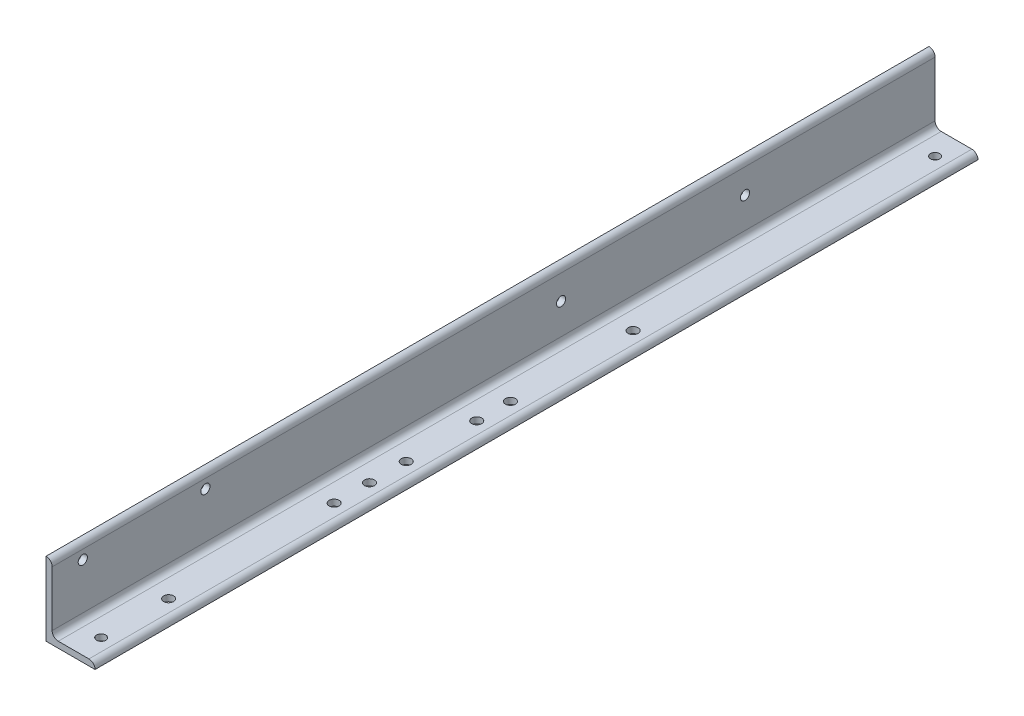
ISO-10303-21;
HEADER;
FILE_DESCRIPTION(('STEP AP214'),'2;1');
FILE_NAME('part.step','',(''),(''),'','','');
FILE_SCHEMA(('AUTOMOTIVE_DESIGN { 1 0 10303 214 1 1 1 1 }'));
ENDSEC;
DATA;
#1=APPLICATION_CONTEXT('core data for automotive mechanical design processes');
#2=APPLICATION_PROTOCOL_DEFINITION('international standard','automotive_design',2000,#1);
#3=PRODUCT_CONTEXT('',#1,'mechanical');
#4=PRODUCT('Part','Part','',(#3));
#5=PRODUCT_RELATED_PRODUCT_CATEGORY('part','',(#4));
#6=PRODUCT_DEFINITION_FORMATION('','',#4);
#7=PRODUCT_DEFINITION_CONTEXT('part definition',#1,'design');
#8=PRODUCT_DEFINITION('design','',#6,#7);
#9=PRODUCT_DEFINITION_SHAPE('','',#8);
#10=(LENGTH_UNIT() NAMED_UNIT(*) SI_UNIT(.MILLI.,.METRE.));
#11=(NAMED_UNIT(*) PLANE_ANGLE_UNIT() SI_UNIT($,.RADIAN.));
#12=(NAMED_UNIT(*) SI_UNIT($,.STERADIAN.) SOLID_ANGLE_UNIT());
#13=UNCERTAINTY_MEASURE_WITH_UNIT(LENGTH_MEASURE(1.E-05),#10,'distance_accuracy_value','');
#14=(GEOMETRIC_REPRESENTATION_CONTEXT(3) GLOBAL_UNCERTAINTY_ASSIGNED_CONTEXT((#13)) GLOBAL_UNIT_ASSIGNED_CONTEXT((#10,
#11,#12)) REPRESENTATION_CONTEXT('',''));
#15=CARTESIAN_POINT('',(0.,0.,0.));
#16=DIRECTION('',(0.,0.,1.));
#17=DIRECTION('',(1.,0.,0.));
#18=AXIS2_PLACEMENT_3D('',#15,#16,#17);
#19=CARTESIAN_POINT('',(101.6,0.,914.4));
#20=DIRECTION('',(0.,1.,0.));
#21=DIRECTION('',(-1.,0.,0.));
#22=AXIS2_PLACEMENT_3D('',#19,#20,#21);
#23=PLANE('',#22);
#24=CARTESIAN_POINT('',(63.5,0.,85.725));
#25=DIRECTION('',(0.,1.,0.));
#26=DIRECTION('',(-1.,0.,0.));
#27=AXIS2_PLACEMENT_3D('',#24,#25,#26);
#28=CIRCLE('',#27,10.31875);
#29=CARTESIAN_POINT('',(53.18125,0.,85.725));
#30=VERTEX_POINT('',#29);
#31=EDGE_CURVE('E224',#30,#30,#28,.F.);
#32=ORIENTED_EDGE('',*,*,#31,.F.);
#33=EDGE_LOOP('',(#32));
#34=FACE_BOUND('',#33,.T.);
#35=CARTESIAN_POINT('',(63.5,0.,307.975));
#36=DIRECTION('',(0.,1.,0.));
#37=DIRECTION('',(-1.,0.,0.));
#38=AXIS2_PLACEMENT_3D('',#35,#36,#37);
#39=CIRCLE('',#38,10.31875);
#40=CARTESIAN_POINT('',(53.18125,0.,307.975));
#41=VERTEX_POINT('',#40);
#42=EDGE_CURVE('E218',#41,#41,#39,.F.);
#43=ORIENTED_EDGE('',*,*,#42,.F.);
#44=EDGE_LOOP('',(#43));
#45=FACE_BOUND('',#44,.T.);
#46=CARTESIAN_POINT('',(63.5,0.,-238.125));
#47=DIRECTION('',(0.,1.,0.));
#48=DIRECTION('',(-1.,0.,0.));
#49=AXIS2_PLACEMENT_3D('',#46,#47,#48);
#50=CIRCLE('',#49,10.31875);
#51=CARTESIAN_POINT('',(53.18125,0.,-238.125));
#52=VERTEX_POINT('',#51);
#53=EDGE_CURVE('E212',#52,#52,#50,.F.);
#54=ORIENTED_EDGE('',*,*,#53,.F.);
#55=EDGE_LOOP('',(#54));
#56=FACE_BOUND('',#55,.T.);
#57=CARTESIAN_POINT('',(63.5,0.,231.775));
#58=DIRECTION('',(0.,1.,0.));
#59=DIRECTION('',(-1.,0.,0.));
#60=AXIS2_PLACEMENT_3D('',#57,#58,#59);
#61=CIRCLE('',#60,10.31875);
#62=CARTESIAN_POINT('',(53.18125,0.,231.775));
#63=VERTEX_POINT('',#62);
#64=EDGE_CURVE('E206',#63,#63,#61,.F.);
#65=ORIENTED_EDGE('',*,*,#64,.F.);
#66=EDGE_LOOP('',(#65));
#67=FACE_BOUND('',#66,.T.);
#68=CARTESIAN_POINT('',(63.5,0.,15.875));
#69=DIRECTION('',(0.,1.,0.));
#70=DIRECTION('',(-1.,0.,0.));
#71=AXIS2_PLACEMENT_3D('',#68,#69,#70);
#72=CIRCLE('',#71,10.31875);
#73=CARTESIAN_POINT('',(53.18125,0.,15.875));
#74=VERTEX_POINT('',#73);
#75=EDGE_CURVE('E200',#74,#74,#72,.F.);
#76=ORIENTED_EDGE('',*,*,#75,.F.);
#77=EDGE_LOOP('',(#76));
#78=FACE_BOUND('',#77,.T.);
#79=CARTESIAN_POINT('',(63.5,0.,381.));
#80=DIRECTION('',(0.,1.,0.));
#81=DIRECTION('',(-1.,0.,0.));
#82=AXIS2_PLACEMENT_3D('',#79,#80,#81);
#83=CIRCLE('',#82,10.31875);
#84=CARTESIAN_POINT('',(53.18125,0.,381.));
#85=VERTEX_POINT('',#84);
#86=EDGE_CURVE('E194',#85,#85,#83,.F.);
#87=ORIENTED_EDGE('',*,*,#86,.F.);
#88=EDGE_LOOP('',(#87));
#89=FACE_BOUND('',#88,.T.);
#90=CARTESIAN_POINT('',(63.5,0.,723.9));
#91=DIRECTION('',(0.,1.,0.));
#92=DIRECTION('',(-1.,0.,0.));
#93=AXIS2_PLACEMENT_3D('',#90,#91,#92);
#94=CIRCLE('',#93,10.31875);
#95=CARTESIAN_POINT('',(53.18125,0.,723.9));
#96=VERTEX_POINT('',#95);
#97=EDGE_CURVE('E188',#96,#96,#94,.F.);
#98=ORIENTED_EDGE('',*,*,#97,.F.);
#99=EDGE_LOOP('',(#98));
#100=FACE_BOUND('',#99,.T.);
#101=CARTESIAN_POINT('',(63.5,0.,-863.6));
#102=DIRECTION('',(0.,1.,0.));
#103=DIRECTION('',(-1.,0.,0.));
#104=AXIS2_PLACEMENT_3D('',#101,#102,#103);
#105=CIRCLE('',#104,9.525);
#106=CARTESIAN_POINT('',(53.975,0.,-863.6));
#107=VERTEX_POINT('',#106);
#108=EDGE_CURVE('E182',#107,#107,#105,.F.);
#109=ORIENTED_EDGE('',*,*,#108,.F.);
#110=EDGE_LOOP('',(#109));
#111=FACE_BOUND('',#110,.T.);
#112=CARTESIAN_POINT('',(63.5,0.,863.6));
#113=DIRECTION('',(0.,1.,0.));
#114=DIRECTION('',(-1.,0.,0.));
#115=AXIS2_PLACEMENT_3D('',#112,#113,#114);
#116=CIRCLE('',#115,9.525);
#117=CARTESIAN_POINT('',(53.975,0.,863.6));
#118=VERTEX_POINT('',#117);
#119=EDGE_CURVE('E123',#118,#118,#116,.F.);
#120=ORIENTED_EDGE('',*,*,#119,.F.);
#121=EDGE_LOOP('',(#120));
#122=FACE_BOUND('',#121,.T.);
#123=DIRECTION('',(1.,0.,0.));
#124=VECTOR('',#123,1.);
#125=CARTESIAN_POINT('',(101.6,0.,-914.4));
#126=LINE('',#125,#124);
#127=CARTESIAN_POINT('',(0.,0.,-914.4));
#128=VERTEX_POINT('',#127);
#129=CARTESIAN_POINT('',(101.6,0.,-914.4));
#130=VERTEX_POINT('',#129);
#131=EDGE_CURVE('E119',#128,#130,#126,.T.);
#132=ORIENTED_EDGE('',*,*,#131,.T.);
#133=DIRECTION('',(0.,0.,-1.));
#134=VECTOR('',#133,1.);
#135=CARTESIAN_POINT('',(101.6,0.,914.4));
#136=LINE('',#135,#134);
#137=CARTESIAN_POINT('',(101.6,0.,914.4));
#138=VERTEX_POINT('',#137);
#139=EDGE_CURVE('E11',#138,#130,#136,.T.);
#140=ORIENTED_EDGE('',*,*,#139,.F.);
#141=DIRECTION('',(1.,0.,0.));
#142=VECTOR('',#141,1.);
#143=CARTESIAN_POINT('',(101.6,0.,914.4));
#144=LINE('',#143,#142);
#145=CARTESIAN_POINT('',(0.,0.,914.4));
#146=VERTEX_POINT('',#145);
#147=EDGE_CURVE('E136',#146,#138,#144,.T.);
#148=ORIENTED_EDGE('',*,*,#147,.F.);
#149=DIRECTION('',(0.,0.,-1.));
#150=VECTOR('',#149,1.);
#151=CARTESIAN_POINT('',(0.,0.,914.4));
#152=LINE('',#151,#150);
#153=EDGE_CURVE('E115',#146,#128,#152,.T.);
#154=ORIENTED_EDGE('',*,*,#153,.T.);
#155=EDGE_LOOP('',(#132,#140,#148,#154));
#156=FACE_BOUND('',#155,.T.);
#157=ADVANCED_FACE('F17',(#34,#45,#56,#67,#78,#89,#100,#111,#122,#156),#23,.F.);
#158=CARTESIAN_POINT('',(101.6,0.00508000000000622,914.4));
#159=DIRECTION('',(-1.,0.,0.));
#160=DIRECTION('',(0.,0.,1.));
#161=AXIS2_PLACEMENT_3D('',#158,#159,#160);
#162=PLANE('',#161);
#163=DIRECTION('',(0.,1.,0.));
#164=VECTOR('',#163,1.);
#165=CARTESIAN_POINT('',(101.6,0.00508000000000622,-914.4));
#166=LINE('',#165,#164);
#167=CARTESIAN_POINT('',(101.6,0.00508000000000622,-914.4));
#168=VERTEX_POINT('',#167);
#169=EDGE_CURVE('E122',#130,#168,#166,.T.);
#170=ORIENTED_EDGE('',*,*,#169,.T.);
#171=DIRECTION('',(0.,0.,-1.));
#172=VECTOR('',#171,1.);
#173=CARTESIAN_POINT('',(101.6,0.00508000000000622,914.4));
#174=LINE('',#173,#172);
#175=CARTESIAN_POINT('',(101.6,0.00508000000000622,914.4));
#176=VERTEX_POINT('',#175);
#177=EDGE_CURVE('E25',#176,#168,#174,.T.);
#178=ORIENTED_EDGE('',*,*,#177,.F.);
#179=DIRECTION('',(0.,1.,0.));
#180=VECTOR('',#179,1.);
#181=CARTESIAN_POINT('',(101.6,0.00508000000000622,914.4));
#182=LINE('',#181,#180);
#183=EDGE_CURVE('E79',#138,#176,#182,.T.);
#184=ORIENTED_EDGE('',*,*,#183,.F.);
#185=ORIENTED_EDGE('',*,*,#139,.T.);
#186=EDGE_LOOP('',(#170,#178,#184,#185));
#187=FACE_BOUND('',#186,.T.);
#188=ADVANCED_FACE('F287',(#187),#162,.F.);
#189=CARTESIAN_POINT('',(88.90508,0.00508000000000467,914.4));
#190=DIRECTION('',(0.,0.,-1.));
#191=DIRECTION('',(-1.,0.,0.));
#192=AXIS2_PLACEMENT_3D('',#189,#190,#191);
#193=CYLINDRICAL_SURFACE('',#192,12.69492);
#194=CARTESIAN_POINT('',(88.90508,0.00508000000000467,-914.4));
#195=DIRECTION('',(0.,0.,1.));
#196=DIRECTION('',(1.,0.,0.));
#197=AXIS2_PLACEMENT_3D('',#194,#195,#196);
#198=CIRCLE('',#197,12.69492);
#199=CARTESIAN_POINT('',(88.90508,12.7,-914.4));
#200=VERTEX_POINT('',#199);
#201=EDGE_CURVE('E125',#168,#200,#198,.T.);
#202=ORIENTED_EDGE('',*,*,#201,.T.);
#203=DIRECTION('',(0.,0.,-1.));
#204=VECTOR('',#203,1.);
#205=CARTESIAN_POINT('',(88.90508,12.7,914.4));
#206=LINE('',#205,#204);
#207=CARTESIAN_POINT('',(88.90508,12.7,914.4));
#208=VERTEX_POINT('',#207);
#209=EDGE_CURVE('E146',#208,#200,#206,.T.);
#210=ORIENTED_EDGE('',*,*,#209,.F.);
#211=CARTESIAN_POINT('',(88.90508,0.00508000000000467,914.4));
#212=DIRECTION('',(0.,0.,1.));
#213=DIRECTION('',(1.,0.,0.));
#214=AXIS2_PLACEMENT_3D('',#211,#212,#213);
#215=CIRCLE('',#214,12.69492);
#216=EDGE_CURVE('E154',#176,#208,#215,.T.);
#217=ORIENTED_EDGE('',*,*,#216,.F.);
#218=ORIENTED_EDGE('',*,*,#177,.T.);
#219=EDGE_LOOP('',(#202,#210,#217,#218));
#220=FACE_BOUND('',#219,.T.);
#221=ADVANCED_FACE('F152',(#220),#193,.T.);
#222=CARTESIAN_POINT('',(25.4,12.7,914.4));
#223=DIRECTION('',(0.,-1.,0.));
#224=DIRECTION('',(0.,0.,-1.));
#225=AXIS2_PLACEMENT_3D('',#222,#223,#224);
#226=PLANE('',#225);
#227=CARTESIAN_POINT('',(63.5,12.7,85.725));
#228=DIRECTION('',(0.,1.,0.));
#229=DIRECTION('',(-1.,0.,0.));
#230=AXIS2_PLACEMENT_3D('',#227,#228,#229);
#231=CIRCLE('',#230,10.31875);
#232=CARTESIAN_POINT('',(53.18125,12.7,85.725));
#233=VERTEX_POINT('',#232);
#234=EDGE_CURVE('E227',#233,#233,#231,.T.);
#235=ORIENTED_EDGE('',*,*,#234,.F.);
#236=EDGE_LOOP('',(#235));
#237=FACE_BOUND('',#236,.T.);
#238=CARTESIAN_POINT('',(63.5,12.7,307.975));
#239=DIRECTION('',(0.,1.,0.));
#240=DIRECTION('',(-1.,0.,0.));
#241=AXIS2_PLACEMENT_3D('',#238,#239,#240);
#242=CIRCLE('',#241,10.31875);
#243=CARTESIAN_POINT('',(53.18125,12.7,307.975));
#244=VERTEX_POINT('',#243);
#245=EDGE_CURVE('E221',#244,#244,#242,.T.);
#246=ORIENTED_EDGE('',*,*,#245,.F.);
#247=EDGE_LOOP('',(#246));
#248=FACE_BOUND('',#247,.T.);
#249=CARTESIAN_POINT('',(63.5,12.7,-238.125));
#250=DIRECTION('',(0.,1.,0.));
#251=DIRECTION('',(-1.,0.,0.));
#252=AXIS2_PLACEMENT_3D('',#249,#250,#251);
#253=CIRCLE('',#252,10.31875);
#254=CARTESIAN_POINT('',(53.18125,12.7,-238.125));
#255=VERTEX_POINT('',#254);
#256=EDGE_CURVE('E215',#255,#255,#253,.T.);
#257=ORIENTED_EDGE('',*,*,#256,.F.);
#258=EDGE_LOOP('',(#257));
#259=FACE_BOUND('',#258,.T.);
#260=CARTESIAN_POINT('',(63.5,12.7,231.775));
#261=DIRECTION('',(0.,1.,0.));
#262=DIRECTION('',(-1.,0.,0.));
#263=AXIS2_PLACEMENT_3D('',#260,#261,#262);
#264=CIRCLE('',#263,10.31875);
#265=CARTESIAN_POINT('',(53.18125,12.7,231.775));
#266=VERTEX_POINT('',#265);
#267=EDGE_CURVE('E209',#266,#266,#264,.T.);
#268=ORIENTED_EDGE('',*,*,#267,.F.);
#269=EDGE_LOOP('',(#268));
#270=FACE_BOUND('',#269,.T.);
#271=CARTESIAN_POINT('',(63.5,12.7,15.875));
#272=DIRECTION('',(0.,1.,0.));
#273=DIRECTION('',(-1.,0.,0.));
#274=AXIS2_PLACEMENT_3D('',#271,#272,#273);
#275=CIRCLE('',#274,10.31875);
#276=CARTESIAN_POINT('',(53.18125,12.7,15.875));
#277=VERTEX_POINT('',#276);
#278=EDGE_CURVE('E203',#277,#277,#275,.T.);
#279=ORIENTED_EDGE('',*,*,#278,.F.);
#280=EDGE_LOOP('',(#279));
#281=FACE_BOUND('',#280,.T.);
#282=CARTESIAN_POINT('',(63.5,12.7,381.));
#283=DIRECTION('',(0.,1.,0.));
#284=DIRECTION('',(-1.,0.,0.));
#285=AXIS2_PLACEMENT_3D('',#282,#283,#284);
#286=CIRCLE('',#285,10.31875);
#287=CARTESIAN_POINT('',(53.18125,12.7,381.));
#288=VERTEX_POINT('',#287);
#289=EDGE_CURVE('E197',#288,#288,#286,.T.);
#290=ORIENTED_EDGE('',*,*,#289,.F.);
#291=EDGE_LOOP('',(#290));
#292=FACE_BOUND('',#291,.T.);
#293=CARTESIAN_POINT('',(63.5,12.7,723.9));
#294=DIRECTION('',(0.,1.,0.));
#295=DIRECTION('',(-1.,0.,0.));
#296=AXIS2_PLACEMENT_3D('',#293,#294,#295);
#297=CIRCLE('',#296,10.31875);
#298=CARTESIAN_POINT('',(53.18125,12.7,723.9));
#299=VERTEX_POINT('',#298);
#300=EDGE_CURVE('E191',#299,#299,#297,.T.);
#301=ORIENTED_EDGE('',*,*,#300,.F.);
#302=EDGE_LOOP('',(#301));
#303=FACE_BOUND('',#302,.T.);
#304=CARTESIAN_POINT('',(63.5,12.7,-863.6));
#305=DIRECTION('',(0.,1.,0.));
#306=DIRECTION('',(-1.,0.,0.));
#307=AXIS2_PLACEMENT_3D('',#304,#305,#306);
#308=CIRCLE('',#307,9.525);
#309=CARTESIAN_POINT('',(53.975,12.7,-863.6));
#310=VERTEX_POINT('',#309);
#311=EDGE_CURVE('E185',#310,#310,#308,.T.);
#312=ORIENTED_EDGE('',*,*,#311,.F.);
#313=EDGE_LOOP('',(#312));
#314=FACE_BOUND('',#313,.T.);
#315=CARTESIAN_POINT('',(63.5,12.7,863.6));
#316=DIRECTION('',(0.,1.,0.));
#317=DIRECTION('',(-1.,0.,0.));
#318=AXIS2_PLACEMENT_3D('',#315,#316,#317);
#319=CIRCLE('',#318,9.525);
#320=CARTESIAN_POINT('',(53.975,12.7,863.6));
#321=VERTEX_POINT('',#320);
#322=EDGE_CURVE('E179',#321,#321,#319,.T.);
#323=ORIENTED_EDGE('',*,*,#322,.F.);
#324=EDGE_LOOP('',(#323));
#325=FACE_BOUND('',#324,.T.);
#326=DIRECTION('',(-1.,0.,0.));
#327=VECTOR('',#326,1.);
#328=CARTESIAN_POINT('',(25.4,12.7,-914.4));
#329=LINE('',#328,#327);
#330=CARTESIAN_POINT('',(25.4,12.7,-914.4));
#331=VERTEX_POINT('',#330);
#332=EDGE_CURVE('E127',#200,#331,#329,.T.);
#333=ORIENTED_EDGE('',*,*,#332,.T.);
#334=DIRECTION('',(0.,0.,-1.));
#335=VECTOR('',#334,1.);
#336=CARTESIAN_POINT('',(25.4,12.7,914.4));
#337=LINE('',#336,#335);
#338=CARTESIAN_POINT('',(25.4,12.7,914.4));
#339=VERTEX_POINT('',#338);
#340=EDGE_CURVE('E143',#339,#331,#337,.T.);
#341=ORIENTED_EDGE('',*,*,#340,.F.);
#342=DIRECTION('',(-1.,0.,0.));
#343=VECTOR('',#342,1.);
#344=CARTESIAN_POINT('',(25.4,12.7,914.4));
#345=LINE('',#344,#343);
#346=EDGE_CURVE('E170',#208,#339,#345,.T.);
#347=ORIENTED_EDGE('',*,*,#346,.F.);
#348=ORIENTED_EDGE('',*,*,#209,.T.);
#349=EDGE_LOOP('',(#333,#341,#347,#348));
#350=FACE_BOUND('',#349,.T.);
#351=ADVANCED_FACE('F163',(#237,#248,#259,#270,#281,#292,#303,#314,#325,#350),#226,.F.);
#352=CARTESIAN_POINT('',(25.4,25.4,914.4));
#353=DIRECTION('',(0.,0.,-1.));
#354=DIRECTION('',(-1.,0.,0.));
#355=AXIS2_PLACEMENT_3D('',#352,#353,#354);
#356=CYLINDRICAL_SURFACE('',#355,12.7);
#357=CARTESIAN_POINT('',(25.4,25.4,-914.4));
#358=DIRECTION('',(0.,0.,-1.));
#359=DIRECTION('',(-1.,0.,0.));
#360=AXIS2_PLACEMENT_3D('',#357,#358,#359);
#361=CIRCLE('',#360,12.7);
#362=CARTESIAN_POINT('',(12.7,25.4,-914.4));
#363=VERTEX_POINT('',#362);
#364=EDGE_CURVE('E129',#331,#363,#361,.T.);
#365=ORIENTED_EDGE('',*,*,#364,.T.);
#366=DIRECTION('',(0.,0.,-1.));
#367=VECTOR('',#366,1.);
#368=CARTESIAN_POINT('',(12.7,25.4,914.4));
#369=LINE('',#368,#367);
#370=CARTESIAN_POINT('',(12.7,25.4,914.4));
#371=VERTEX_POINT('',#370);
#372=EDGE_CURVE('E140',#371,#363,#369,.T.);
#373=ORIENTED_EDGE('',*,*,#372,.F.);
#374=CARTESIAN_POINT('',(25.4,25.4,914.4));
#375=DIRECTION('',(0.,0.,-1.));
#376=DIRECTION('',(-1.,0.,0.));
#377=AXIS2_PLACEMENT_3D('',#374,#375,#376);
#378=CIRCLE('',#377,12.7);
#379=EDGE_CURVE('E169',#339,#371,#378,.T.);
#380=ORIENTED_EDGE('',*,*,#379,.F.);
#381=ORIENTED_EDGE('',*,*,#340,.T.);
#382=EDGE_LOOP('',(#365,#373,#380,#381));
#383=FACE_BOUND('',#382,.T.);
#384=ADVANCED_FACE('F167',(#383),#356,.F.);
#385=CARTESIAN_POINT('',(12.7,139.70508,914.4));
#386=DIRECTION('',(-1.,0.,0.));
#387=DIRECTION('',(0.,-1.,0.));
#388=AXIS2_PLACEMENT_3D('',#385,#386,#387);
#389=PLANE('',#388);
#390=CARTESIAN_POINT('',(12.7,88.9,-520.7));
#391=DIRECTION('',(1.,0.,0.));
#392=DIRECTION('',(0.,1.,0.));
#393=AXIS2_PLACEMENT_3D('',#390,#391,#392);
#394=CIRCLE('',#393,9.525);
#395=CARTESIAN_POINT('',(12.7,98.425,-520.7));
#396=VERTEX_POINT('',#395);
#397=EDGE_CURVE('E251',#396,#396,#394,.T.);
#398=ORIENTED_EDGE('',*,*,#397,.F.);
#399=EDGE_LOOP('',(#398));
#400=FACE_BOUND('',#399,.T.);
#401=CARTESIAN_POINT('',(12.7,88.9,-139.7));
#402=DIRECTION('',(1.,0.,0.));
#403=DIRECTION('',(0.,1.,0.));
#404=AXIS2_PLACEMENT_3D('',#401,#402,#403);
#405=CIRCLE('',#404,9.525);
#406=CARTESIAN_POINT('',(12.7,98.425,-139.7));
#407=VERTEX_POINT('',#406);
#408=EDGE_CURVE('E245',#407,#407,#405,.T.);
#409=ORIENTED_EDGE('',*,*,#408,.F.);
#410=EDGE_LOOP('',(#409));
#411=FACE_BOUND('',#410,.T.);
#412=CARTESIAN_POINT('',(12.7,120.65,596.9));
#413=DIRECTION('',(1.,0.,0.));
#414=DIRECTION('',(0.,1.,0.));
#415=AXIS2_PLACEMENT_3D('',#412,#413,#414);
#416=CIRCLE('',#415,9.525);
#417=CARTESIAN_POINT('',(12.7,130.175,596.9));
#418=VERTEX_POINT('',#417);
#419=EDGE_CURVE('E239',#418,#418,#416,.T.);
#420=ORIENTED_EDGE('',*,*,#419,.F.);
#421=EDGE_LOOP('',(#420));
#422=FACE_BOUND('',#421,.T.);
#423=CARTESIAN_POINT('',(12.7,120.65,850.9));
#424=DIRECTION('',(1.,0.,0.));
#425=DIRECTION('',(0.,1.,0.));
#426=AXIS2_PLACEMENT_3D('',#423,#424,#425);
#427=CIRCLE('',#426,9.525);
#428=CARTESIAN_POINT('',(12.7,130.175,850.9));
#429=VERTEX_POINT('',#428);
#430=EDGE_CURVE('E233',#429,#429,#427,.T.);
#431=ORIENTED_EDGE('',*,*,#430,.F.);
#432=EDGE_LOOP('',(#431));
#433=FACE_BOUND('',#432,.T.);
#434=DIRECTION('',(0.,1.,0.));
#435=VECTOR('',#434,1.);
#436=CARTESIAN_POINT('',(12.7,139.70508,-914.4));
#437=LINE('',#436,#435);
#438=CARTESIAN_POINT('',(12.7,139.70508,-914.4));
#439=VERTEX_POINT('',#438);
#440=EDGE_CURVE('E131',#363,#439,#437,.T.);
#441=ORIENTED_EDGE('',*,*,#440,.T.);
#442=DIRECTION('',(0.,0.,-1.));
#443=VECTOR('',#442,1.);
#444=CARTESIAN_POINT('',(12.7,139.70508,914.4));
#445=LINE('',#444,#443);
#446=CARTESIAN_POINT('',(12.7,139.70508,914.4));
#447=VERTEX_POINT('',#446);
#448=EDGE_CURVE('E110',#447,#439,#445,.T.);
#449=ORIENTED_EDGE('',*,*,#448,.F.);
#450=DIRECTION('',(0.,1.,0.));
#451=VECTOR('',#450,1.);
#452=CARTESIAN_POINT('',(12.7,139.70508,914.4));
#453=LINE('',#452,#451);
#454=EDGE_CURVE('E101',#371,#447,#453,.T.);
#455=ORIENTED_EDGE('',*,*,#454,.F.);
#456=ORIENTED_EDGE('',*,*,#372,.T.);
#457=EDGE_LOOP('',(#441,#449,#455,#456));
#458=FACE_BOUND('',#457,.T.);
#459=ADVANCED_FACE('F258',(#400,#411,#422,#433,#458),#389,.F.);
#460=CARTESIAN_POINT('',(0.00508000000000078,139.70508,914.4));
#461=DIRECTION('',(0.,0.,-1.));
#462=DIRECTION('',(-1.,0.,0.));
#463=AXIS2_PLACEMENT_3D('',#460,#461,#462);
#464=CYLINDRICAL_SURFACE('',#463,12.69492);
#465=CARTESIAN_POINT('',(0.00508000000000078,139.70508,-914.4));
#466=DIRECTION('',(0.,0.,1.));
#467=DIRECTION('',(-1.,0.,0.));
#468=AXIS2_PLACEMENT_3D('',#465,#466,#467);
#469=CIRCLE('',#468,12.69492);
#470=CARTESIAN_POINT('',(0.00508,152.4,-914.4));
#471=VERTEX_POINT('',#470);
#472=EDGE_CURVE('E109',#439,#471,#469,.T.);
#473=ORIENTED_EDGE('',*,*,#472,.T.);
#474=DIRECTION('',(0.,0.,-1.));
#475=VECTOR('',#474,1.);
#476=CARTESIAN_POINT('',(0.00508,152.4,914.4));
#477=LINE('',#476,#475);
#478=CARTESIAN_POINT('',(0.00508,152.4,914.4));
#479=VERTEX_POINT('',#478);
#480=EDGE_CURVE('E106',#479,#471,#477,.T.);
#481=ORIENTED_EDGE('',*,*,#480,.F.);
#482=CARTESIAN_POINT('',(0.00508000000000078,139.70508,914.4));
#483=DIRECTION('',(0.,0.,1.));
#484=DIRECTION('',(-1.,0.,0.));
#485=AXIS2_PLACEMENT_3D('',#482,#483,#484);
#486=CIRCLE('',#485,12.69492);
#487=EDGE_CURVE('E95',#447,#479,#486,.T.);
#488=ORIENTED_EDGE('',*,*,#487,.F.);
#489=ORIENTED_EDGE('',*,*,#448,.T.);
#490=EDGE_LOOP('',(#473,#481,#488,#489));
#491=FACE_BOUND('',#490,.T.);
#492=ADVANCED_FACE('F107',(#491),#464,.T.);
#493=CARTESIAN_POINT('',(0.,152.4,914.4));
#494=DIRECTION('',(0.,-1.,0.));
#495=DIRECTION('',(0.,0.,-1.));
#496=AXIS2_PLACEMENT_3D('',#493,#494,#495);
#497=PLANE('',#496);
#498=DIRECTION('',(-1.,0.,0.));
#499=VECTOR('',#498,1.);
#500=CARTESIAN_POINT('',(0.,152.4,-914.4));
#501=LINE('',#500,#499);
#502=CARTESIAN_POINT('',(0.,152.4,-914.4));
#503=VERTEX_POINT('',#502);
#504=EDGE_CURVE('E65',#471,#503,#501,.T.);
#505=ORIENTED_EDGE('',*,*,#504,.T.);
#506=DIRECTION('',(0.,0.,-1.));
#507=VECTOR('',#506,1.);
#508=CARTESIAN_POINT('',(0.,152.4,914.4));
#509=LINE('',#508,#507);
#510=CARTESIAN_POINT('',(0.,152.4,914.4));
#511=VERTEX_POINT('',#510);
#512=EDGE_CURVE('E111',#511,#503,#509,.T.);
#513=ORIENTED_EDGE('',*,*,#512,.F.);
#514=DIRECTION('',(-1.,0.,0.));
#515=VECTOR('',#514,1.);
#516=CARTESIAN_POINT('',(0.,152.4,914.4));
#517=LINE('',#516,#515);
#518=EDGE_CURVE('E99',#479,#511,#517,.T.);
#519=ORIENTED_EDGE('',*,*,#518,.F.);
#520=ORIENTED_EDGE('',*,*,#480,.T.);
#521=EDGE_LOOP('',(#505,#513,#519,#520));
#522=FACE_BOUND('',#521,.T.);
#523=ADVANCED_FACE('F113',(#522),#497,.F.);
#524=CARTESIAN_POINT('',(0.,0.,914.4));
#525=DIRECTION('',(1.,0.,0.));
#526=DIRECTION('',(0.,0.,-1.));
#527=AXIS2_PLACEMENT_3D('',#524,#525,#526);
#528=PLANE('',#527);
#529=CARTESIAN_POINT('',(0.,88.9,-520.7));
#530=DIRECTION('',(1.,0.,0.));
#531=DIRECTION('',(0.,0.,-1.));
#532=AXIS2_PLACEMENT_3D('',#529,#530,#531);
#533=CIRCLE('',#532,9.525);
#534=CARTESIAN_POINT('',(0.,88.9,-530.225));
#535=VERTEX_POINT('',#534);
#536=EDGE_CURVE('E248',#535,#535,#533,.F.);
#537=ORIENTED_EDGE('',*,*,#536,.F.);
#538=EDGE_LOOP('',(#537));
#539=FACE_BOUND('',#538,.T.);
#540=CARTESIAN_POINT('',(0.,88.9,-139.7));
#541=DIRECTION('',(1.,0.,0.));
#542=DIRECTION('',(0.,0.,-1.));
#543=AXIS2_PLACEMENT_3D('',#540,#541,#542);
#544=CIRCLE('',#543,9.525);
#545=CARTESIAN_POINT('',(0.,88.9,-149.225));
#546=VERTEX_POINT('',#545);
#547=EDGE_CURVE('E242',#546,#546,#544,.F.);
#548=ORIENTED_EDGE('',*,*,#547,.F.);
#549=EDGE_LOOP('',(#548));
#550=FACE_BOUND('',#549,.T.);
#551=CARTESIAN_POINT('',(0.,120.65,596.9));
#552=DIRECTION('',(1.,0.,0.));
#553=DIRECTION('',(0.,0.,-1.));
#554=AXIS2_PLACEMENT_3D('',#551,#552,#553);
#555=CIRCLE('',#554,9.525);
#556=CARTESIAN_POINT('',(0.,120.65,587.375));
#557=VERTEX_POINT('',#556);
#558=EDGE_CURVE('E236',#557,#557,#555,.F.);
#559=ORIENTED_EDGE('',*,*,#558,.F.);
#560=EDGE_LOOP('',(#559));
#561=FACE_BOUND('',#560,.T.);
#562=CARTESIAN_POINT('',(0.,120.65,850.9));
#563=DIRECTION('',(1.,0.,0.));
#564=DIRECTION('',(0.,0.,-1.));
#565=AXIS2_PLACEMENT_3D('',#562,#563,#564);
#566=CIRCLE('',#565,9.525);
#567=CARTESIAN_POINT('',(0.,120.65,841.375));
#568=VERTEX_POINT('',#567);
#569=EDGE_CURVE('E230',#568,#568,#566,.F.);
#570=ORIENTED_EDGE('',*,*,#569,.F.);
#571=EDGE_LOOP('',(#570));
#572=FACE_BOUND('',#571,.T.);
#573=DIRECTION('',(0.,-1.,0.));
#574=VECTOR('',#573,1.);
#575=CARTESIAN_POINT('',(0.,0.,-914.4));
#576=LINE('',#575,#574);
#577=EDGE_CURVE('E71',#503,#128,#576,.T.);
#578=ORIENTED_EDGE('',*,*,#577,.T.);
#579=ORIENTED_EDGE('',*,*,#153,.F.);
#580=DIRECTION('',(0.,-1.,0.));
#581=VECTOR('',#580,1.);
#582=CARTESIAN_POINT('',(0.,0.,914.4));
#583=LINE('',#582,#581);
#584=EDGE_CURVE('E33',#511,#146,#583,.T.);
#585=ORIENTED_EDGE('',*,*,#584,.F.);
#586=ORIENTED_EDGE('',*,*,#512,.T.);
#587=EDGE_LOOP('',(#578,#579,#585,#586));
#588=FACE_BOUND('',#587,.T.);
#589=ADVANCED_FACE('F271',(#539,#550,#561,#572,#588),#528,.F.);
#590=CARTESIAN_POINT('',(0.00508000000000078,139.70508,914.4));
#591=DIRECTION('',(0.,0.,-1.));
#592=DIRECTION('',(-1.,0.,0.));
#593=AXIS2_PLACEMENT_3D('',#590,#591,#592);
#594=PLANE('',#593);
#595=ORIENTED_EDGE('',*,*,#147,.T.);
#596=ORIENTED_EDGE('',*,*,#183,.T.);
#597=ORIENTED_EDGE('',*,*,#216,.T.);
#598=ORIENTED_EDGE('',*,*,#346,.T.);
#599=ORIENTED_EDGE('',*,*,#379,.T.);
#600=ORIENTED_EDGE('',*,*,#454,.T.);
#601=ORIENTED_EDGE('',*,*,#487,.T.);
#602=ORIENTED_EDGE('',*,*,#518,.T.);
#603=ORIENTED_EDGE('',*,*,#584,.T.);
#604=EDGE_LOOP('',(#595,#596,#597,#598,#599,#600,#601,#602,#603));
#605=FACE_BOUND('',#604,.T.);
#606=ADVANCED_FACE('F97',(#605),#594,.F.);
#607=CARTESIAN_POINT('',(0.00508000000000078,139.70508,-914.4));
#608=DIRECTION('',(0.,0.,-1.));
#609=DIRECTION('',(-1.,0.,0.));
#610=AXIS2_PLACEMENT_3D('',#607,#608,#609);
#611=PLANE('',#610);
#612=ORIENTED_EDGE('',*,*,#131,.F.);
#613=ORIENTED_EDGE('',*,*,#577,.F.);
#614=ORIENTED_EDGE('',*,*,#504,.F.);
#615=ORIENTED_EDGE('',*,*,#472,.F.);
#616=ORIENTED_EDGE('',*,*,#440,.F.);
#617=ORIENTED_EDGE('',*,*,#364,.F.);
#618=ORIENTED_EDGE('',*,*,#332,.F.);
#619=ORIENTED_EDGE('',*,*,#201,.F.);
#620=ORIENTED_EDGE('',*,*,#169,.F.);
#621=EDGE_LOOP('',(#612,#613,#614,#615,#616,#617,#618,#619,#620));
#622=FACE_BOUND('',#621,.T.);
#623=ADVANCED_FACE('F158',(#622),#611,.T.);
#624=CARTESIAN_POINT('',(63.5,-0.001000000000001,863.6));
#625=DIRECTION('',(0.,1.,0.));
#626=DIRECTION('',(-1.,0.,0.));
#627=AXIS2_PLACEMENT_3D('',#624,#625,#626);
#628=CYLINDRICAL_SURFACE('',#627,9.525);
#629=ORIENTED_EDGE('',*,*,#322,.T.);
#630=EDGE_LOOP('',(#629));
#631=FACE_BOUND('',#630,.T.);
#632=ORIENTED_EDGE('',*,*,#119,.T.);
#633=EDGE_LOOP('',(#632));
#634=FACE_BOUND('',#633,.T.);
#635=ADVANCED_FACE('F311',(#631,#634),#628,.F.);
#636=CARTESIAN_POINT('',(63.5,-0.001000000000001,-863.6));
#637=DIRECTION('',(0.,1.,0.));
#638=DIRECTION('',(-1.,0.,0.));
#639=AXIS2_PLACEMENT_3D('',#636,#637,#638);
#640=CYLINDRICAL_SURFACE('',#639,9.525);
#641=ORIENTED_EDGE('',*,*,#311,.T.);
#642=EDGE_LOOP('',(#641));
#643=FACE_BOUND('',#642,.T.);
#644=ORIENTED_EDGE('',*,*,#108,.T.);
#645=EDGE_LOOP('',(#644));
#646=FACE_BOUND('',#645,.T.);
#647=ADVANCED_FACE('F313',(#643,#646),#640,.F.);
#648=CARTESIAN_POINT('',(63.5,-0.001000000000001,723.9));
#649=DIRECTION('',(0.,1.,0.));
#650=DIRECTION('',(-1.,0.,0.));
#651=AXIS2_PLACEMENT_3D('',#648,#649,#650);
#652=CYLINDRICAL_SURFACE('',#651,10.31875);
#653=ORIENTED_EDGE('',*,*,#300,.T.);
#654=EDGE_LOOP('',(#653));
#655=FACE_BOUND('',#654,.T.);
#656=ORIENTED_EDGE('',*,*,#97,.T.);
#657=EDGE_LOOP('',(#656));
#658=FACE_BOUND('',#657,.T.);
#659=ADVANCED_FACE('F321',(#655,#658),#652,.F.);
#660=CARTESIAN_POINT('',(63.5,-0.001000000000001,381.));
#661=DIRECTION('',(0.,1.,0.));
#662=DIRECTION('',(-1.,0.,0.));
#663=AXIS2_PLACEMENT_3D('',#660,#661,#662);
#664=CYLINDRICAL_SURFACE('',#663,10.31875);
#665=ORIENTED_EDGE('',*,*,#289,.T.);
#666=EDGE_LOOP('',(#665));
#667=FACE_BOUND('',#666,.T.);
#668=ORIENTED_EDGE('',*,*,#86,.T.);
#669=EDGE_LOOP('',(#668));
#670=FACE_BOUND('',#669,.T.);
#671=ADVANCED_FACE('F327',(#667,#670),#664,.F.);
#672=CARTESIAN_POINT('',(63.5,-0.001000000000001,15.875));
#673=DIRECTION('',(0.,1.,0.));
#674=DIRECTION('',(-1.,0.,0.));
#675=AXIS2_PLACEMENT_3D('',#672,#673,#674);
#676=CYLINDRICAL_SURFACE('',#675,10.31875);
#677=ORIENTED_EDGE('',*,*,#278,.T.);
#678=EDGE_LOOP('',(#677));
#679=FACE_BOUND('',#678,.T.);
#680=ORIENTED_EDGE('',*,*,#75,.T.);
#681=EDGE_LOOP('',(#680));
#682=FACE_BOUND('',#681,.T.);
#683=ADVANCED_FACE('F331',(#679,#682),#676,.F.);
#684=CARTESIAN_POINT('',(63.5,-0.001000000000001,231.775));
#685=DIRECTION('',(0.,1.,0.));
#686=DIRECTION('',(-1.,0.,0.));
#687=AXIS2_PLACEMENT_3D('',#684,#685,#686);
#688=CYLINDRICAL_SURFACE('',#687,10.31875);
#689=ORIENTED_EDGE('',*,*,#267,.T.);
#690=EDGE_LOOP('',(#689));
#691=FACE_BOUND('',#690,.T.);
#692=ORIENTED_EDGE('',*,*,#64,.T.);
#693=EDGE_LOOP('',(#692));
#694=FACE_BOUND('',#693,.T.);
#695=ADVANCED_FACE('F335',(#691,#694),#688,.F.);
#696=CARTESIAN_POINT('',(63.5,-0.001000000000001,-238.125));
#697=DIRECTION('',(0.,1.,0.));
#698=DIRECTION('',(-1.,0.,0.));
#699=AXIS2_PLACEMENT_3D('',#696,#697,#698);
#700=CYLINDRICAL_SURFACE('',#699,10.31875);
#701=ORIENTED_EDGE('',*,*,#256,.T.);
#702=EDGE_LOOP('',(#701));
#703=FACE_BOUND('',#702,.T.);
#704=ORIENTED_EDGE('',*,*,#53,.T.);
#705=EDGE_LOOP('',(#704));
#706=FACE_BOUND('',#705,.T.);
#707=ADVANCED_FACE('F339',(#703,#706),#700,.F.);
#708=CARTESIAN_POINT('',(63.5,-0.001000000000001,307.975));
#709=DIRECTION('',(0.,1.,0.));
#710=DIRECTION('',(-1.,0.,0.));
#711=AXIS2_PLACEMENT_3D('',#708,#709,#710);
#712=CYLINDRICAL_SURFACE('',#711,10.31875);
#713=ORIENTED_EDGE('',*,*,#245,.T.);
#714=EDGE_LOOP('',(#713));
#715=FACE_BOUND('',#714,.T.);
#716=ORIENTED_EDGE('',*,*,#42,.T.);
#717=EDGE_LOOP('',(#716));
#718=FACE_BOUND('',#717,.T.);
#719=ADVANCED_FACE('F343',(#715,#718),#712,.F.);
#720=CARTESIAN_POINT('',(63.5,-0.001000000000001,85.725));
#721=DIRECTION('',(0.,1.,0.));
#722=DIRECTION('',(-1.,0.,0.));
#723=AXIS2_PLACEMENT_3D('',#720,#721,#722);
#724=CYLINDRICAL_SURFACE('',#723,10.31875);
#725=ORIENTED_EDGE('',*,*,#234,.T.);
#726=EDGE_LOOP('',(#725));
#727=FACE_BOUND('',#726,.T.);
#728=ORIENTED_EDGE('',*,*,#31,.T.);
#729=EDGE_LOOP('',(#728));
#730=FACE_BOUND('',#729,.T.);
#731=ADVANCED_FACE('F347',(#727,#730),#724,.F.);
#732=CARTESIAN_POINT('',(-0.00100000000001314,120.65,850.9));
#733=DIRECTION('',(1.,0.,0.));
#734=DIRECTION('',(0.,1.,0.));
#735=AXIS2_PLACEMENT_3D('',#732,#733,#734);
#736=CYLINDRICAL_SURFACE('',#735,9.525);
#737=ORIENTED_EDGE('',*,*,#430,.T.);
#738=EDGE_LOOP('',(#737));
#739=FACE_BOUND('',#738,.T.);
#740=ORIENTED_EDGE('',*,*,#569,.T.);
#741=EDGE_LOOP('',(#740));
#742=FACE_BOUND('',#741,.T.);
#743=ADVANCED_FACE('F351',(#739,#742),#736,.F.);
#744=CARTESIAN_POINT('',(-0.00100000000001314,120.65,596.9));
#745=DIRECTION('',(1.,0.,0.));
#746=DIRECTION('',(0.,1.,0.));
#747=AXIS2_PLACEMENT_3D('',#744,#745,#746);
#748=CYLINDRICAL_SURFACE('',#747,9.525);
#749=ORIENTED_EDGE('',*,*,#419,.T.);
#750=EDGE_LOOP('',(#749));
#751=FACE_BOUND('',#750,.T.);
#752=ORIENTED_EDGE('',*,*,#558,.T.);
#753=EDGE_LOOP('',(#752));
#754=FACE_BOUND('',#753,.T.);
#755=ADVANCED_FACE('F355',(#751,#754),#748,.F.);
#756=CARTESIAN_POINT('',(-0.00100000000000967,88.9,-139.7));
#757=DIRECTION('',(1.,0.,0.));
#758=DIRECTION('',(0.,1.,0.));
#759=AXIS2_PLACEMENT_3D('',#756,#757,#758);
#760=CYLINDRICAL_SURFACE('',#759,9.525);
#761=ORIENTED_EDGE('',*,*,#408,.T.);
#762=EDGE_LOOP('',(#761));
#763=FACE_BOUND('',#762,.T.);
#764=ORIENTED_EDGE('',*,*,#547,.T.);
#765=EDGE_LOOP('',(#764));
#766=FACE_BOUND('',#765,.T.);
#767=ADVANCED_FACE('F359',(#763,#766),#760,.F.);
#768=CARTESIAN_POINT('',(-0.00100000000000967,88.9,-520.7));
#769=DIRECTION('',(1.,0.,0.));
#770=DIRECTION('',(0.,1.,0.));
#771=AXIS2_PLACEMENT_3D('',#768,#769,#770);
#772=CYLINDRICAL_SURFACE('',#771,9.525);
#773=ORIENTED_EDGE('',*,*,#397,.T.);
#774=EDGE_LOOP('',(#773));
#775=FACE_BOUND('',#774,.T.);
#776=ORIENTED_EDGE('',*,*,#536,.T.);
#777=EDGE_LOOP('',(#776));
#778=FACE_BOUND('',#777,.T.);
#779=ADVANCED_FACE('F255',(#775,#778),#772,.F.);
#780=CLOSED_SHELL('',(#157,#188,#221,#351,#384,#459,#492,#523,#589,#606,#623,#635,#647,#659,
#671,#683,#695,#707,#719,#731,#743,#755,#767,#779));
#781=MANIFOLD_SOLID_BREP('B1',#780);
#782=ADVANCED_BREP_SHAPE_REPRESENTATION('',(#18,#781),#14);
#783=SHAPE_DEFINITION_REPRESENTATION(#9,#782);
ENDSEC;
END-ISO-10303-21;
